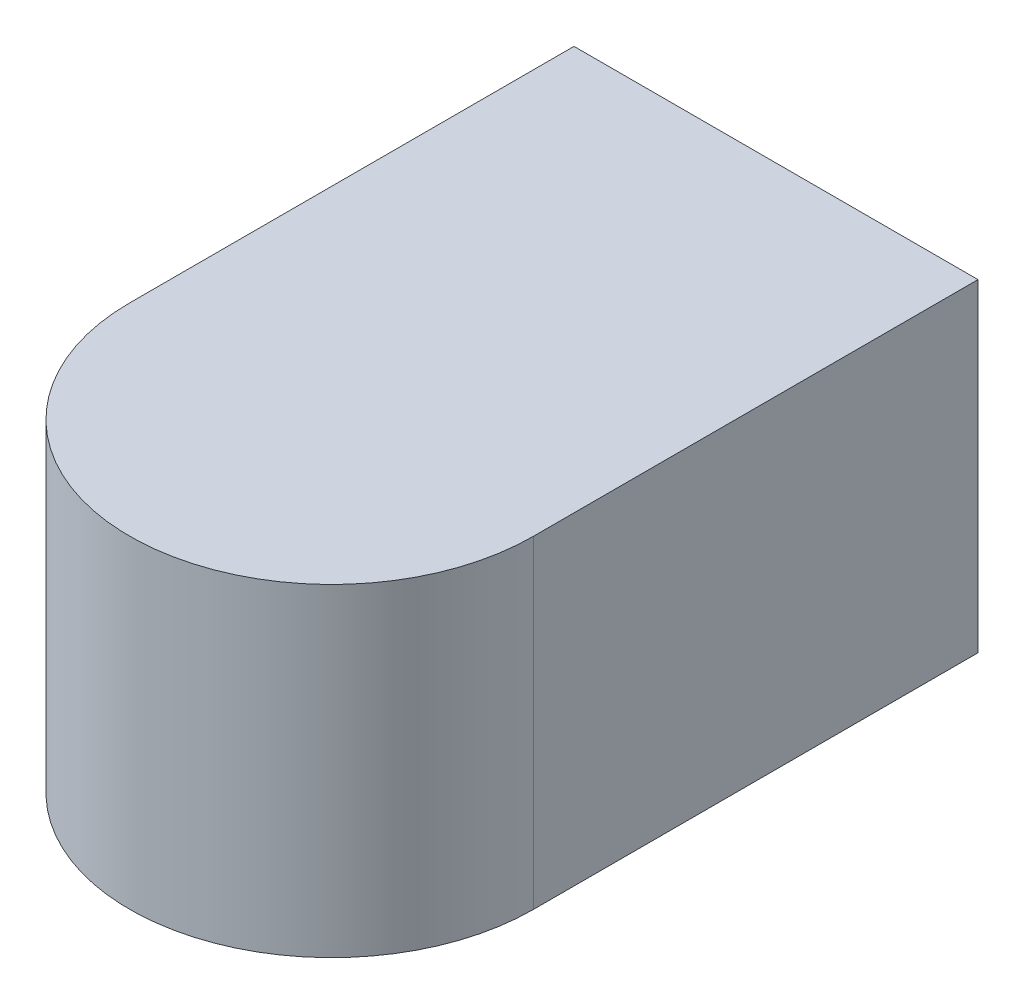
ISO-10303-21;
HEADER;
FILE_DESCRIPTION(('STEP AP214'),'2;1');
FILE_NAME('part.step','',(''),(''),'','','');
FILE_SCHEMA(('AUTOMOTIVE_DESIGN { 1 0 10303 214 1 1 1 1 }'));
ENDSEC;
DATA;
#1=APPLICATION_CONTEXT('core data for automotive mechanical design processes');
#2=APPLICATION_PROTOCOL_DEFINITION('international standard','automotive_design',2000,#1);
#3=PRODUCT_CONTEXT('',#1,'mechanical');
#4=PRODUCT('Part','Part','',(#3));
#5=PRODUCT_RELATED_PRODUCT_CATEGORY('part','',(#4));
#6=PRODUCT_DEFINITION_FORMATION('','',#4);
#7=PRODUCT_DEFINITION_CONTEXT('part definition',#1,'design');
#8=PRODUCT_DEFINITION('design','',#6,#7);
#9=PRODUCT_DEFINITION_SHAPE('','',#8);
#10=(LENGTH_UNIT() NAMED_UNIT(*) SI_UNIT(.MILLI.,.METRE.));
#11=(NAMED_UNIT(*) PLANE_ANGLE_UNIT() SI_UNIT($,.RADIAN.));
#12=(NAMED_UNIT(*) SI_UNIT($,.STERADIAN.) SOLID_ANGLE_UNIT());
#13=UNCERTAINTY_MEASURE_WITH_UNIT(LENGTH_MEASURE(1.E-05),#10,'distance_accuracy_value','');
#14=(GEOMETRIC_REPRESENTATION_CONTEXT(3) GLOBAL_UNCERTAINTY_ASSIGNED_CONTEXT((#13)) GLOBAL_UNIT_ASSIGNED_CONTEXT((#10,
#11,#12)) REPRESENTATION_CONTEXT('',''));
#15=CARTESIAN_POINT('',(0.,0.,0.));
#16=DIRECTION('',(0.,0.,1.));
#17=DIRECTION('',(1.,0.,0.));
#18=AXIS2_PLACEMENT_3D('',#15,#16,#17);
#19=CARTESIAN_POINT('',(0.,0.,0.));
#20=DIRECTION('',(0.,1.,0.));
#21=DIRECTION('',(1.,0.,0.));
#22=AXIS2_PLACEMENT_3D('',#19,#20,#21);
#23=PLANE('',#22);
#24=DIRECTION('',(-1.,0.,0.));
#25=VECTOR('',#24,1.);
#26=CARTESIAN_POINT('',(-0.125,0.,-1.5));
#27=LINE('',#26,#25);
#28=CARTESIAN_POINT('',(-0.125,0.,-1.5));
#29=VERTEX_POINT('',#28);
#30=CARTESIAN_POINT('',(-0.375,0.,-1.5));
#31=VERTEX_POINT('',#30);
#32=EDGE_CURVE('E11',#29,#31,#27,.T.);
#33=ORIENTED_EDGE('',*,*,#32,.F.);
#34=DIRECTION('',(0.,0.,-1.));
#35=VECTOR('',#34,1.);
#36=CARTESIAN_POINT('',(-0.125,0.,-1.225));
#37=LINE('',#36,#35);
#38=CARTESIAN_POINT('',(-0.125,0.,-1.225));
#39=VERTEX_POINT('',#38);
#40=EDGE_CURVE('E24',#39,#29,#37,.T.);
#41=ORIENTED_EDGE('',*,*,#40,.F.);
#42=CARTESIAN_POINT('',(-0.25,0.,-1.225));
#43=DIRECTION('',(0.,1.,0.));
#44=DIRECTION('',(-1.,0.,0.));
#45=AXIS2_PLACEMENT_3D('',#42,#43,#44);
#46=CIRCLE('',#45,0.125);
#47=CARTESIAN_POINT('',(-0.375,0.,-1.225));
#48=VERTEX_POINT('',#47);
#49=EDGE_CURVE('E61',#48,#39,#46,.T.);
#50=ORIENTED_EDGE('',*,*,#49,.F.);
#51=DIRECTION('',(0.,0.,1.));
#52=VECTOR('',#51,1.);
#53=CARTESIAN_POINT('',(-0.375,0.,-1.5));
#54=LINE('',#53,#52);
#55=EDGE_CURVE('E37',#31,#48,#54,.T.);
#56=ORIENTED_EDGE('',*,*,#55,.F.);
#57=EDGE_LOOP('',(#33,#41,#50,#56));
#58=FACE_BOUND('',#57,.T.);
#59=ADVANCED_FACE('F17',(#58),#23,.F.);
#60=CARTESIAN_POINT('',(-0.375,0.,-1.5));
#61=DIRECTION('',(-1.,0.,0.));
#62=DIRECTION('',(0.,0.,1.));
#63=AXIS2_PLACEMENT_3D('',#60,#61,#62);
#64=PLANE('',#63);
#65=DIRECTION('',(0.,1.,0.));
#66=VECTOR('',#65,1.);
#67=CARTESIAN_POINT('',(-0.375,0.,-1.225));
#68=LINE('',#67,#66);
#69=CARTESIAN_POINT('',(-0.375,0.2,-1.225));
#70=VERTEX_POINT('',#69);
#71=EDGE_CURVE('E84',#48,#70,#68,.T.);
#72=ORIENTED_EDGE('',*,*,#71,.T.);
#73=DIRECTION('',(0.,0.,1.));
#74=VECTOR('',#73,1.);
#75=CARTESIAN_POINT('',(-0.375,0.2,-1.5));
#76=LINE('',#75,#74);
#77=CARTESIAN_POINT('',(-0.375,0.2,-1.5));
#78=VERTEX_POINT('',#77);
#79=EDGE_CURVE('E74',#78,#70,#76,.T.);
#80=ORIENTED_EDGE('',*,*,#79,.F.);
#81=DIRECTION('',(0.,1.,0.));
#82=VECTOR('',#81,1.);
#83=CARTESIAN_POINT('',(-0.375,0.,-1.5));
#84=LINE('',#83,#82);
#85=EDGE_CURVE('E81',#31,#78,#84,.T.);
#86=ORIENTED_EDGE('',*,*,#85,.F.);
#87=ORIENTED_EDGE('',*,*,#55,.T.);
#88=EDGE_LOOP('',(#72,#80,#86,#87));
#89=FACE_BOUND('',#88,.T.);
#90=ADVANCED_FACE('F89',(#89),#64,.T.);
#91=CARTESIAN_POINT('',(-0.125,0.,-1.5));
#92=DIRECTION('',(0.,0.,-1.));
#93=DIRECTION('',(-1.,0.,0.));
#94=AXIS2_PLACEMENT_3D('',#91,#92,#93);
#95=PLANE('',#94);
#96=ORIENTED_EDGE('',*,*,#85,.T.);
#97=DIRECTION('',(-1.,0.,0.));
#98=VECTOR('',#97,1.);
#99=CARTESIAN_POINT('',(-0.125,0.2,-1.5));
#100=LINE('',#99,#98);
#101=CARTESIAN_POINT('',(-0.125,0.2,-1.5));
#102=VERTEX_POINT('',#101);
#103=EDGE_CURVE('E79',#102,#78,#100,.T.);
#104=ORIENTED_EDGE('',*,*,#103,.F.);
#105=DIRECTION('',(0.,1.,0.));
#106=VECTOR('',#105,1.);
#107=CARTESIAN_POINT('',(-0.125,0.,-1.5));
#108=LINE('',#107,#106);
#109=EDGE_CURVE('E67',#29,#102,#108,.T.);
#110=ORIENTED_EDGE('',*,*,#109,.F.);
#111=ORIENTED_EDGE('',*,*,#32,.T.);
#112=EDGE_LOOP('',(#96,#104,#110,#111));
#113=FACE_BOUND('',#112,.T.);
#114=ADVANCED_FACE('F91',(#113),#95,.T.);
#115=CARTESIAN_POINT('',(-0.125,0.,-1.225));
#116=DIRECTION('',(1.,0.,0.));
#117=DIRECTION('',(0.,0.,-1.));
#118=AXIS2_PLACEMENT_3D('',#115,#116,#117);
#119=PLANE('',#118);
#120=ORIENTED_EDGE('',*,*,#109,.T.);
#121=DIRECTION('',(0.,0.,-1.));
#122=VECTOR('',#121,1.);
#123=CARTESIAN_POINT('',(-0.125,0.2,-1.225));
#124=LINE('',#123,#122);
#125=CARTESIAN_POINT('',(-0.125,0.2,-1.225));
#126=VERTEX_POINT('',#125);
#127=EDGE_CURVE('E62',#126,#102,#124,.T.);
#128=ORIENTED_EDGE('',*,*,#127,.F.);
#129=DIRECTION('',(0.,1.,0.));
#130=VECTOR('',#129,1.);
#131=CARTESIAN_POINT('',(-0.125,0.,-1.225));
#132=LINE('',#131,#130);
#133=EDGE_CURVE('E55',#39,#126,#132,.T.);
#134=ORIENTED_EDGE('',*,*,#133,.F.);
#135=ORIENTED_EDGE('',*,*,#40,.T.);
#136=EDGE_LOOP('',(#120,#128,#134,#135));
#137=FACE_BOUND('',#136,.T.);
#138=ADVANCED_FACE('F65',(#137),#119,.T.);
#139=CARTESIAN_POINT('',(-0.25,0.,-1.225));
#140=DIRECTION('',(0.,1.,0.));
#141=DIRECTION('',(1.,0.,0.));
#142=AXIS2_PLACEMENT_3D('',#139,#140,#141);
#143=CYLINDRICAL_SURFACE('',#142,0.125);
#144=ORIENTED_EDGE('',*,*,#133,.T.);
#145=CARTESIAN_POINT('',(-0.25,0.2,-1.225));
#146=DIRECTION('',(0.,1.,0.));
#147=DIRECTION('',(-1.,0.,0.));
#148=AXIS2_PLACEMENT_3D('',#145,#146,#147);
#149=CIRCLE('',#148,0.125);
#150=EDGE_CURVE('E60',#70,#126,#149,.T.);
#151=ORIENTED_EDGE('',*,*,#150,.F.);
#152=ORIENTED_EDGE('',*,*,#71,.F.);
#153=ORIENTED_EDGE('',*,*,#49,.T.);
#154=EDGE_LOOP('',(#144,#151,#152,#153));
#155=FACE_BOUND('',#154,.T.);
#156=ADVANCED_FACE('F57',(#155),#143,.T.);
#157=CARTESIAN_POINT('',(0.,0.2,0.));
#158=DIRECTION('',(0.,1.,0.));
#159=DIRECTION('',(1.,0.,0.));
#160=AXIS2_PLACEMENT_3D('',#157,#158,#159);
#161=PLANE('',#160);
#162=ORIENTED_EDGE('',*,*,#150,.T.);
#163=ORIENTED_EDGE('',*,*,#127,.T.);
#164=ORIENTED_EDGE('',*,*,#103,.T.);
#165=ORIENTED_EDGE('',*,*,#79,.T.);
#166=EDGE_LOOP('',(#162,#163,#164,#165));
#167=FACE_BOUND('',#166,.T.);
#168=ADVANCED_FACE('F72',(#167),#161,.T.);
#169=CLOSED_SHELL('',(#59,#90,#114,#138,#156,#168));
#170=MANIFOLD_SOLID_BREP('B1',#169);
#171=ADVANCED_BREP_SHAPE_REPRESENTATION('',(#18,#170),#14);
#172=SHAPE_DEFINITION_REPRESENTATION(#9,#171);
ENDSEC;
END-ISO-10303-21;
